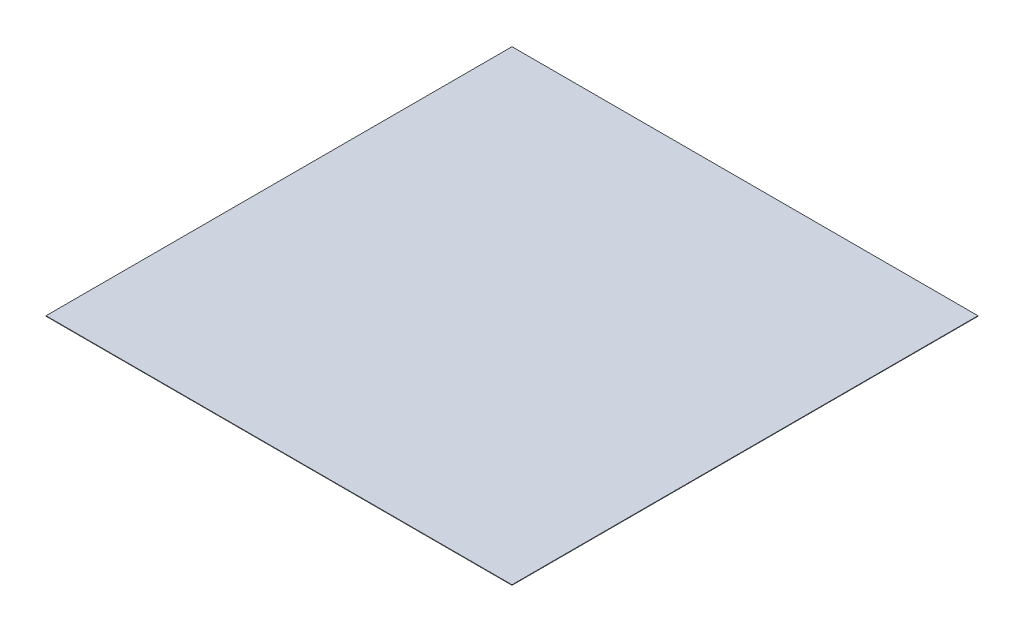
ISO-10303-21;
HEADER;
FILE_DESCRIPTION(('STEP AP214'),'2;1');
FILE_NAME('part.step','',(''),(''),'','','');
FILE_SCHEMA(('AUTOMOTIVE_DESIGN { 1 0 10303 214 1 1 1 1 }'));
ENDSEC;
DATA;
#1=APPLICATION_CONTEXT('core data for automotive mechanical design processes');
#2=APPLICATION_PROTOCOL_DEFINITION('international standard','automotive_design',2000,#1);
#3=PRODUCT_CONTEXT('',#1,'mechanical');
#4=PRODUCT('Part','Part','',(#3));
#5=PRODUCT_RELATED_PRODUCT_CATEGORY('part','',(#4));
#6=PRODUCT_DEFINITION_FORMATION('','',#4);
#7=PRODUCT_DEFINITION_CONTEXT('part definition',#1,'design');
#8=PRODUCT_DEFINITION('design','',#6,#7);
#9=PRODUCT_DEFINITION_SHAPE('','',#8);
#10=(LENGTH_UNIT() NAMED_UNIT(*) SI_UNIT(.MILLI.,.METRE.));
#11=(NAMED_UNIT(*) PLANE_ANGLE_UNIT() SI_UNIT($,.RADIAN.));
#12=(NAMED_UNIT(*) SI_UNIT($,.STERADIAN.) SOLID_ANGLE_UNIT());
#13=UNCERTAINTY_MEASURE_WITH_UNIT(LENGTH_MEASURE(1.E-05),#10,'distance_accuracy_value','');
#14=(GEOMETRIC_REPRESENTATION_CONTEXT(3) GLOBAL_UNCERTAINTY_ASSIGNED_CONTEXT((#13)) GLOBAL_UNIT_ASSIGNED_CONTEXT((#10,
#11,#12)) REPRESENTATION_CONTEXT('',''));
#15=CARTESIAN_POINT('',(0.,0.,0.));
#16=DIRECTION('',(0.,0.,1.));
#17=DIRECTION('',(1.,0.,0.));
#18=AXIS2_PLACEMENT_3D('',#15,#16,#17);
#19=CARTESIAN_POINT('',(15000.,30.,15000.));
#20=DIRECTION('',(-1.,0.,0.));
#21=DIRECTION('',(0.,0.,1.));
#22=AXIS2_PLACEMENT_3D('',#19,#20,#21);
#23=PLANE('',#22);
#24=DIRECTION('',(0.,0.,-1.));
#25=VECTOR('',#24,1.);
#26=CARTESIAN_POINT('',(15000.,0.,15000.));
#27=LINE('',#26,#25);
#28=CARTESIAN_POINT('',(15000.,0.,15000.));
#29=VERTEX_POINT('',#28);
#30=CARTESIAN_POINT('',(15000.,0.,-15000.));
#31=VERTEX_POINT('',#30);
#32=EDGE_CURVE('E106',#29,#31,#27,.T.);
#33=ORIENTED_EDGE('',*,*,#32,.T.);
#34=DIRECTION('',(0.,-1.,0.));
#35=VECTOR('',#34,1.);
#36=CARTESIAN_POINT('',(15000.,30.,-15000.));
#37=LINE('',#36,#35);
#38=CARTESIAN_POINT('',(15000.,30.,-15000.));
#39=VERTEX_POINT('',#38);
#40=EDGE_CURVE('E11',#39,#31,#37,.T.);
#41=ORIENTED_EDGE('',*,*,#40,.F.);
#42=DIRECTION('',(0.,0.,-1.));
#43=VECTOR('',#42,1.);
#44=CARTESIAN_POINT('',(15000.,30.,15000.));
#45=LINE('',#44,#43);
#46=CARTESIAN_POINT('',(15000.,30.,15000.));
#47=VERTEX_POINT('',#46);
#48=EDGE_CURVE('E94',#47,#39,#45,.T.);
#49=ORIENTED_EDGE('',*,*,#48,.F.);
#50=DIRECTION('',(0.,-1.,0.));
#51=VECTOR('',#50,1.);
#52=CARTESIAN_POINT('',(15000.,30.,15000.));
#53=LINE('',#52,#51);
#54=EDGE_CURVE('E102',#47,#29,#53,.T.);
#55=ORIENTED_EDGE('',*,*,#54,.T.);
#56=EDGE_LOOP('',(#33,#41,#49,#55));
#57=FACE_BOUND('',#56,.T.);
#58=ADVANCED_FACE('F43',(#57),#23,.F.);
#59=CARTESIAN_POINT('',(-15000.,30.,-15000.));
#60=DIRECTION('',(0.,0.,1.));
#61=DIRECTION('',(1.,0.,0.));
#62=AXIS2_PLACEMENT_3D('',#59,#60,#61);
#63=PLANE('',#62);
#64=DIRECTION('',(-1.,0.,0.));
#65=VECTOR('',#64,1.);
#66=CARTESIAN_POINT('',(-15000.,0.,-15000.));
#67=LINE('',#66,#65);
#68=CARTESIAN_POINT('',(-15000.,0.,-15000.));
#69=VERTEX_POINT('',#68);
#70=EDGE_CURVE('E98',#31,#69,#67,.T.);
#71=ORIENTED_EDGE('',*,*,#70,.T.);
#72=DIRECTION('',(0.,-1.,0.));
#73=VECTOR('',#72,1.);
#74=CARTESIAN_POINT('',(-15000.,30.,-15000.));
#75=LINE('',#74,#73);
#76=CARTESIAN_POINT('',(-15000.,30.,-15000.));
#77=VERTEX_POINT('',#76);
#78=EDGE_CURVE('E51',#77,#69,#75,.T.);
#79=ORIENTED_EDGE('',*,*,#78,.F.);
#80=DIRECTION('',(-1.,0.,0.));
#81=VECTOR('',#80,1.);
#82=CARTESIAN_POINT('',(-15000.,30.,-15000.));
#83=LINE('',#82,#81);
#84=EDGE_CURVE('E89',#39,#77,#83,.T.);
#85=ORIENTED_EDGE('',*,*,#84,.F.);
#86=ORIENTED_EDGE('',*,*,#40,.T.);
#87=EDGE_LOOP('',(#71,#79,#85,#86));
#88=FACE_BOUND('',#87,.T.);
#89=ADVANCED_FACE('F97',(#88),#63,.F.);
#90=CARTESIAN_POINT('',(-15000.,30.,15000.));
#91=DIRECTION('',(1.,0.,0.));
#92=DIRECTION('',(0.,0.,-1.));
#93=AXIS2_PLACEMENT_3D('',#90,#91,#92);
#94=PLANE('',#93);
#95=DIRECTION('',(0.,0.,1.));
#96=VECTOR('',#95,1.);
#97=CARTESIAN_POINT('',(-15000.,0.,15000.));
#98=LINE('',#97,#96);
#99=CARTESIAN_POINT('',(-15000.,0.,15000.));
#100=VERTEX_POINT('',#99);
#101=EDGE_CURVE('E76',#69,#100,#98,.T.);
#102=ORIENTED_EDGE('',*,*,#101,.T.);
#103=DIRECTION('',(0.,-1.,0.));
#104=VECTOR('',#103,1.);
#105=CARTESIAN_POINT('',(-15000.,30.,15000.));
#106=LINE('',#105,#104);
#107=CARTESIAN_POINT('',(-15000.,30.,15000.));
#108=VERTEX_POINT('',#107);
#109=EDGE_CURVE('E99',#108,#100,#106,.T.);
#110=ORIENTED_EDGE('',*,*,#109,.F.);
#111=DIRECTION('',(0.,0.,1.));
#112=VECTOR('',#111,1.);
#113=CARTESIAN_POINT('',(-15000.,30.,15000.));
#114=LINE('',#113,#112);
#115=EDGE_CURVE('E92',#77,#108,#114,.T.);
#116=ORIENTED_EDGE('',*,*,#115,.F.);
#117=ORIENTED_EDGE('',*,*,#78,.T.);
#118=EDGE_LOOP('',(#102,#110,#116,#117));
#119=FACE_BOUND('',#118,.T.);
#120=ADVANCED_FACE('F100',(#119),#94,.F.);
#121=CARTESIAN_POINT('',(-15000.,30.,15000.));
#122=DIRECTION('',(0.,0.,-1.));
#123=DIRECTION('',(-1.,0.,0.));
#124=AXIS2_PLACEMENT_3D('',#121,#122,#123);
#125=PLANE('',#124);
#126=DIRECTION('',(1.,0.,0.));
#127=VECTOR('',#126,1.);
#128=CARTESIAN_POINT('',(-15000.,0.,15000.));
#129=LINE('',#128,#127);
#130=EDGE_CURVE('E82',#100,#29,#129,.T.);
#131=ORIENTED_EDGE('',*,*,#130,.T.);
#132=ORIENTED_EDGE('',*,*,#54,.F.);
#133=DIRECTION('',(1.,0.,0.));
#134=VECTOR('',#133,1.);
#135=CARTESIAN_POINT('',(-15000.,30.,15000.));
#136=LINE('',#135,#134);
#137=EDGE_CURVE('E59',#108,#47,#136,.T.);
#138=ORIENTED_EDGE('',*,*,#137,.F.);
#139=ORIENTED_EDGE('',*,*,#109,.T.);
#140=EDGE_LOOP('',(#131,#132,#138,#139));
#141=FACE_BOUND('',#140,.T.);
#142=ADVANCED_FACE('F113',(#141),#125,.F.);
#143=CARTESIAN_POINT('',(0.,30.,0.));
#144=DIRECTION('',(0.,-1.,0.));
#145=DIRECTION('',(0.,0.,-1.));
#146=AXIS2_PLACEMENT_3D('',#143,#144,#145);
#147=PLANE('',#146);
#148=ORIENTED_EDGE('',*,*,#48,.T.);
#149=ORIENTED_EDGE('',*,*,#84,.T.);
#150=ORIENTED_EDGE('',*,*,#115,.T.);
#151=ORIENTED_EDGE('',*,*,#137,.T.);
#152=EDGE_LOOP('',(#148,#149,#150,#151));
#153=FACE_BOUND('',#152,.T.);
#154=ADVANCED_FACE('F90',(#153),#147,.F.);
#155=CARTESIAN_POINT('',(0.,0.,0.));
#156=DIRECTION('',(0.,-1.,0.));
#157=DIRECTION('',(0.,0.,-1.));
#158=AXIS2_PLACEMENT_3D('',#155,#156,#157);
#159=PLANE('',#158);
#160=ORIENTED_EDGE('',*,*,#32,.F.);
#161=ORIENTED_EDGE('',*,*,#130,.F.);
#162=ORIENTED_EDGE('',*,*,#101,.F.);
#163=ORIENTED_EDGE('',*,*,#70,.F.);
#164=EDGE_LOOP('',(#160,#161,#162,#163));
#165=FACE_BOUND('',#164,.T.);
#166=ADVANCED_FACE('F116',(#165),#159,.T.);
#167=CLOSED_SHELL('',(#58,#89,#120,#142,#154,#166));
#168=MANIFOLD_SOLID_BREP('B2',#167);
#169=ADVANCED_BREP_SHAPE_REPRESENTATION('',(#18,#168),#14);
#170=SHAPE_DEFINITION_REPRESENTATION(#9,#169);
ENDSEC;
END-ISO-10303-21;
